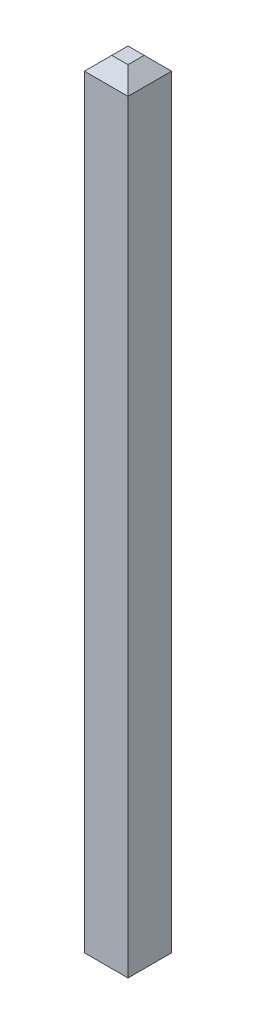
ISO-10303-21;
HEADER;
FILE_DESCRIPTION(('STEP AP214'),'2;1');
FILE_NAME('part.step','',(''),(''),'','','');
FILE_SCHEMA(('AUTOMOTIVE_DESIGN { 1 0 10303 214 1 1 1 1 }'));
ENDSEC;
DATA;
#1=APPLICATION_CONTEXT('core data for automotive mechanical design processes');
#2=APPLICATION_PROTOCOL_DEFINITION('international standard','automotive_design',2000,#1);
#3=PRODUCT_CONTEXT('',#1,'mechanical');
#4=PRODUCT('Part','Part','',(#3));
#5=PRODUCT_RELATED_PRODUCT_CATEGORY('part','',(#4));
#6=PRODUCT_DEFINITION_FORMATION('','',#4);
#7=PRODUCT_DEFINITION_CONTEXT('part definition',#1,'design');
#8=PRODUCT_DEFINITION('design','',#6,#7);
#9=PRODUCT_DEFINITION_SHAPE('','',#8);
#10=(LENGTH_UNIT() NAMED_UNIT(*) SI_UNIT(.MILLI.,.METRE.));
#11=(NAMED_UNIT(*) PLANE_ANGLE_UNIT() SI_UNIT($,.RADIAN.));
#12=(NAMED_UNIT(*) SI_UNIT($,.STERADIAN.) SOLID_ANGLE_UNIT());
#13=UNCERTAINTY_MEASURE_WITH_UNIT(LENGTH_MEASURE(1.E-05),#10,'distance_accuracy_value','');
#14=(GEOMETRIC_REPRESENTATION_CONTEXT(3) GLOBAL_UNCERTAINTY_ASSIGNED_CONTEXT((#13)) GLOBAL_UNIT_ASSIGNED_CONTEXT((#10,
#11,#12)) REPRESENTATION_CONTEXT('',''));
#15=CARTESIAN_POINT('',(0.,0.,0.));
#16=DIRECTION('',(0.,0.,1.));
#17=DIRECTION('',(1.,0.,0.));
#18=AXIS2_PLACEMENT_3D('',#15,#16,#17);
#19=CARTESIAN_POINT('',(0.,11.54,0.));
#20=DIRECTION('',(1.,0.,0.));
#21=DIRECTION('',(0.,0.,-1.));
#22=AXIS2_PLACEMENT_3D('',#19,#20,#21);
#23=PLANE('',#22);
#24=DIRECTION('',(0.,-1.,0.));
#25=VECTOR('',#24,1.);
#26=CARTESIAN_POINT('',(0.,11.54,0.636));
#27=LINE('',#26,#25);
#28=CARTESIAN_POINT('',(0.,11.34,0.636));
#29=VERTEX_POINT('',#28);
#30=CARTESIAN_POINT('',(0.,0.199999999999999,0.636));
#31=VERTEX_POINT('',#30);
#32=EDGE_CURVE('E126',#29,#31,#27,.T.);
#33=ORIENTED_EDGE('',*,*,#32,.F.);
#34=DIRECTION('',(0.,0.,-1.));
#35=VECTOR('',#34,1.);
#36=CARTESIAN_POINT('',(0.,11.34,0.));
#37=LINE('',#36,#35);
#38=CARTESIAN_POINT('',(0.,11.34,0.));
#39=VERTEX_POINT('',#38);
#40=EDGE_CURVE('E151',#29,#39,#37,.T.);
#41=ORIENTED_EDGE('',*,*,#40,.T.);
#42=DIRECTION('',(0.,-1.,0.));
#43=VECTOR('',#42,1.);
#44=CARTESIAN_POINT('',(0.,11.54,0.));
#45=LINE('',#44,#43);
#46=CARTESIAN_POINT('',(0.,0.199999999999999,0.));
#47=VERTEX_POINT('',#46);
#48=EDGE_CURVE('E120',#39,#47,#45,.T.);
#49=ORIENTED_EDGE('',*,*,#48,.T.);
#50=DIRECTION('',(0.,0.,1.));
#51=VECTOR('',#50,1.);
#52=CARTESIAN_POINT('',(0.,0.199999999999999,0.));
#53=LINE('',#52,#51);
#54=EDGE_CURVE('E148',#47,#31,#53,.T.);
#55=ORIENTED_EDGE('',*,*,#54,.T.);
#56=EDGE_LOOP('',(#33,#41,#49,#55));
#57=FACE_BOUND('',#56,.T.);
#58=ADVANCED_FACE('F34',(#57),#23,.F.);
#59=CARTESIAN_POINT('',(0.,11.54,0.636));
#60=DIRECTION('',(0.,0.,-1.));
#61=DIRECTION('',(-1.,0.,0.));
#62=AXIS2_PLACEMENT_3D('',#59,#60,#61);
#63=PLANE('',#62);
#64=DIRECTION('',(0.,-1.,0.));
#65=VECTOR('',#64,1.);
#66=CARTESIAN_POINT('',(0.636,11.54,0.636));
#67=LINE('',#66,#65);
#68=CARTESIAN_POINT('',(0.636,11.34,0.636));
#69=VERTEX_POINT('',#68);
#70=CARTESIAN_POINT('',(0.636,0.199999999999999,0.636));
#71=VERTEX_POINT('',#70);
#72=EDGE_CURVE('E129',#69,#71,#67,.T.);
#73=ORIENTED_EDGE('',*,*,#72,.F.);
#74=DIRECTION('',(-1.,0.,0.));
#75=VECTOR('',#74,1.);
#76=CARTESIAN_POINT('',(0.,11.34,0.636));
#77=LINE('',#76,#75);
#78=EDGE_CURVE('E138',#69,#29,#77,.T.);
#79=ORIENTED_EDGE('',*,*,#78,.T.);
#80=ORIENTED_EDGE('',*,*,#32,.T.);
#81=DIRECTION('',(1.,0.,0.));
#82=VECTOR('',#81,1.);
#83=CARTESIAN_POINT('',(0.,0.199999999999999,0.636));
#84=LINE('',#83,#82);
#85=EDGE_CURVE('E136',#31,#71,#84,.T.);
#86=ORIENTED_EDGE('',*,*,#85,.T.);
#87=EDGE_LOOP('',(#73,#79,#80,#86));
#88=FACE_BOUND('',#87,.T.);
#89=ADVANCED_FACE('F188',(#88),#63,.F.);
#90=CARTESIAN_POINT('',(0.636,11.54,0.));
#91=DIRECTION('',(-1.,0.,0.));
#92=DIRECTION('',(0.,0.,1.));
#93=AXIS2_PLACEMENT_3D('',#90,#91,#92);
#94=PLANE('',#93);
#95=DIRECTION('',(0.,-1.,0.));
#96=VECTOR('',#95,1.);
#97=CARTESIAN_POINT('',(0.636,11.54,0.));
#98=LINE('',#97,#96);
#99=CARTESIAN_POINT('',(0.636,11.34,0.));
#100=VERTEX_POINT('',#99);
#101=CARTESIAN_POINT('',(0.636,0.199999999999999,0.));
#102=VERTEX_POINT('',#101);
#103=EDGE_CURVE('E200',#100,#102,#98,.T.);
#104=ORIENTED_EDGE('',*,*,#103,.F.);
#105=DIRECTION('',(0.,0.,1.));
#106=VECTOR('',#105,1.);
#107=CARTESIAN_POINT('',(0.636,11.34,0.636));
#108=LINE('',#107,#106);
#109=EDGE_CURVE('E143',#100,#69,#108,.T.);
#110=ORIENTED_EDGE('',*,*,#109,.T.);
#111=ORIENTED_EDGE('',*,*,#72,.T.);
#112=DIRECTION('',(0.,0.,-1.));
#113=VECTOR('',#112,1.);
#114=CARTESIAN_POINT('',(0.636,0.199999999999999,0.));
#115=LINE('',#114,#113);
#116=EDGE_CURVE('E141',#71,#102,#115,.T.);
#117=ORIENTED_EDGE('',*,*,#116,.T.);
#118=EDGE_LOOP('',(#104,#110,#111,#117));
#119=FACE_BOUND('',#118,.T.);
#120=ADVANCED_FACE('F198',(#119),#94,.F.);
#121=CARTESIAN_POINT('',(0.,11.54,0.));
#122=DIRECTION('',(0.,0.,1.));
#123=DIRECTION('',(1.,0.,0.));
#124=AXIS2_PLACEMENT_3D('',#121,#122,#123);
#125=PLANE('',#124);
#126=ORIENTED_EDGE('',*,*,#48,.F.);
#127=DIRECTION('',(1.,0.,0.));
#128=VECTOR('',#127,1.);
#129=CARTESIAN_POINT('',(0.636,11.34,0.));
#130=LINE('',#129,#128);
#131=EDGE_CURVE('E117',#39,#100,#130,.T.);
#132=ORIENTED_EDGE('',*,*,#131,.T.);
#133=ORIENTED_EDGE('',*,*,#103,.T.);
#134=DIRECTION('',(-1.,0.,0.));
#135=VECTOR('',#134,1.);
#136=CARTESIAN_POINT('',(0.,0.199999999999999,0.));
#137=LINE('',#136,#135);
#138=EDGE_CURVE('E145',#102,#47,#137,.T.);
#139=ORIENTED_EDGE('',*,*,#138,.T.);
#140=EDGE_LOOP('',(#126,#132,#133,#139));
#141=FACE_BOUND('',#140,.T.);
#142=ADVANCED_FACE('F204',(#141),#125,.F.);
#143=CARTESIAN_POINT('',(0.,11.54,0.));
#144=DIRECTION('',(0.,1.,0.));
#145=DIRECTION('',(0.,0.,1.));
#146=AXIS2_PLACEMENT_3D('',#143,#144,#145);
#147=PLANE('',#146);
#148=DIRECTION('',(0.,0.,1.));
#149=VECTOR('',#148,1.);
#150=CARTESIAN_POINT('',(0.199999999999999,11.54,0.636));
#151=LINE('',#150,#149);
#152=CARTESIAN_POINT('',(0.199999999999999,11.54,0.199999999999999));
#153=VERTEX_POINT('',#152);
#154=CARTESIAN_POINT('',(0.199999999999999,11.54,0.436000000000001));
#155=VERTEX_POINT('',#154);
#156=EDGE_CURVE('E105',#153,#155,#151,.T.);
#157=ORIENTED_EDGE('',*,*,#156,.T.);
#158=DIRECTION('',(1.,0.,0.));
#159=VECTOR('',#158,1.);
#160=CARTESIAN_POINT('',(0.636,11.54,0.436000000000001));
#161=LINE('',#160,#159);
#162=CARTESIAN_POINT('',(0.436000000000001,11.54,0.436000000000001));
#163=VERTEX_POINT('',#162);
#164=EDGE_CURVE('E134',#155,#163,#161,.T.);
#165=ORIENTED_EDGE('',*,*,#164,.T.);
#166=DIRECTION('',(0.,0.,-1.));
#167=VECTOR('',#166,1.);
#168=CARTESIAN_POINT('',(0.436000000000001,11.54,0.));
#169=LINE('',#168,#167);
#170=CARTESIAN_POINT('',(0.436000000000001,11.54,0.199999999999999));
#171=VERTEX_POINT('',#170);
#172=EDGE_CURVE('E108',#163,#171,#169,.T.);
#173=ORIENTED_EDGE('',*,*,#172,.T.);
#174=DIRECTION('',(-1.,0.,0.));
#175=VECTOR('',#174,1.);
#176=CARTESIAN_POINT('',(0.,11.54,0.199999999999999));
#177=LINE('',#176,#175);
#178=EDGE_CURVE('E100',#171,#153,#177,.T.);
#179=ORIENTED_EDGE('',*,*,#178,.T.);
#180=EDGE_LOOP('',(#157,#165,#173,#179));
#181=FACE_BOUND('',#180,.T.);
#182=ADVANCED_FACE('F102',(#181),#147,.T.);
#183=CARTESIAN_POINT('',(0.,0.,0.));
#184=DIRECTION('',(0.,1.,0.));
#185=DIRECTION('',(0.,0.,1.));
#186=AXIS2_PLACEMENT_3D('',#183,#184,#185);
#187=PLANE('',#186);
#188=DIRECTION('',(-1.,0.,0.));
#189=VECTOR('',#188,1.);
#190=CARTESIAN_POINT('',(0.,0.,0.436000000000001));
#191=LINE('',#190,#189);
#192=CARTESIAN_POINT('',(0.436000000000001,0.,0.436000000000001));
#193=VERTEX_POINT('',#192);
#194=CARTESIAN_POINT('',(0.199999999999999,0.,0.436000000000001));
#195=VERTEX_POINT('',#194);
#196=EDGE_CURVE('E153',#193,#195,#191,.T.);
#197=ORIENTED_EDGE('',*,*,#196,.T.);
#198=DIRECTION('',(0.,0.,-1.));
#199=VECTOR('',#198,1.);
#200=CARTESIAN_POINT('',(0.199999999999999,0.,0.));
#201=LINE('',#200,#199);
#202=CARTESIAN_POINT('',(0.199999999999999,0.,0.199999999999999));
#203=VERTEX_POINT('',#202);
#204=EDGE_CURVE('E11',#195,#203,#201,.T.);
#205=ORIENTED_EDGE('',*,*,#204,.T.);
#206=DIRECTION('',(1.,0.,0.));
#207=VECTOR('',#206,1.);
#208=CARTESIAN_POINT('',(0.,0.,0.199999999999999));
#209=LINE('',#208,#207);
#210=CARTESIAN_POINT('',(0.436000000000001,0.,0.199999999999999));
#211=VERTEX_POINT('',#210);
#212=EDGE_CURVE('E43',#203,#211,#209,.T.);
#213=ORIENTED_EDGE('',*,*,#212,.T.);
#214=DIRECTION('',(0.,0.,1.));
#215=VECTOR('',#214,1.);
#216=CARTESIAN_POINT('',(0.436000000000001,0.,0.));
#217=LINE('',#216,#215);
#218=EDGE_CURVE('E155',#211,#193,#217,.T.);
#219=ORIENTED_EDGE('',*,*,#218,.T.);
#220=EDGE_LOOP('',(#197,#205,#213,#219));
#221=FACE_BOUND('',#220,.T.);
#222=ADVANCED_FACE('F177',(#221),#187,.F.);
#223=CARTESIAN_POINT('',(0.,11.54,0.199999999999999));
#224=DIRECTION('',(0.,0.707106781186548,-0.707106781186548));
#225=DIRECTION('',(1.,0.,0.));
#226=AXIS2_PLACEMENT_3D('',#223,#224,#225);
#227=PLANE('',#226);
#228=DIRECTION('',(0.577350269189626,-0.577350269189626,-0.577350269189626));
#229=VECTOR('',#228,1.);
#230=CARTESIAN_POINT('',(0.290666666666668,11.6853333333333,0.345333333333333));
#231=LINE('',#230,#229);
#232=EDGE_CURVE('E121',#100,#171,#231,.F.);
#233=ORIENTED_EDGE('',*,*,#232,.F.);
#234=ORIENTED_EDGE('',*,*,#131,.F.);
#235=DIRECTION('',(-0.577350269189626,-0.577350269189626,-0.577350269189626));
#236=VECTOR('',#235,1.);
#237=CARTESIAN_POINT('',(0.133333333333333,11.4733333333333,0.133333333333332));
#238=LINE('',#237,#236);
#239=EDGE_CURVE('E115',#153,#39,#238,.T.);
#240=ORIENTED_EDGE('',*,*,#239,.F.);
#241=ORIENTED_EDGE('',*,*,#178,.F.);
#242=EDGE_LOOP('',(#233,#234,#240,#241));
#243=FACE_BOUND('',#242,.T.);
#244=ADVANCED_FACE('F116',(#243),#227,.T.);
#245=CARTESIAN_POINT('',(0.199999999999999,11.54,0.));
#246=DIRECTION('',(-0.707106781186548,0.707106781186548,0.));
#247=DIRECTION('',(0.,0.,-1.));
#248=AXIS2_PLACEMENT_3D('',#245,#246,#247);
#249=PLANE('',#248);
#250=ORIENTED_EDGE('',*,*,#239,.T.);
#251=ORIENTED_EDGE('',*,*,#40,.F.);
#252=DIRECTION('',(0.577350269189626,0.577350269189626,-0.577350269189626));
#253=VECTOR('',#252,1.);
#254=CARTESIAN_POINT('',(0.345333333333333,11.6853333333333,0.290666666666668));
#255=LINE('',#254,#253);
#256=EDGE_CURVE('E124',#155,#29,#255,.F.);
#257=ORIENTED_EDGE('',*,*,#256,.F.);
#258=ORIENTED_EDGE('',*,*,#156,.F.);
#259=EDGE_LOOP('',(#250,#251,#257,#258));
#260=FACE_BOUND('',#259,.T.);
#261=ADVANCED_FACE('F123',(#260),#249,.T.);
#262=CARTESIAN_POINT('',(0.436000000000001,11.54,0.));
#263=DIRECTION('',(0.707106781186548,0.707106781186548,0.));
#264=DIRECTION('',(0.,0.,1.));
#265=AXIS2_PLACEMENT_3D('',#262,#263,#264);
#266=PLANE('',#265);
#267=ORIENTED_EDGE('',*,*,#232,.T.);
#268=ORIENTED_EDGE('',*,*,#172,.F.);
#269=DIRECTION('',(0.577350269189626,-0.577350269189626,0.577350269189626));
#270=VECTOR('',#269,1.);
#271=CARTESIAN_POINT('',(0.290666666666668,11.6853333333333,0.290666666666667));
#272=LINE('',#271,#270);
#273=EDGE_CURVE('E158',#69,#163,#272,.F.);
#274=ORIENTED_EDGE('',*,*,#273,.F.);
#275=ORIENTED_EDGE('',*,*,#109,.F.);
#276=EDGE_LOOP('',(#267,#268,#274,#275));
#277=FACE_BOUND('',#276,.T.);
#278=ADVANCED_FACE('F195',(#277),#266,.T.);
#279=CARTESIAN_POINT('',(0.,11.54,0.436000000000001));
#280=DIRECTION('',(0.,0.707106781186548,0.707106781186548));
#281=DIRECTION('',(-1.,0.,0.));
#282=AXIS2_PLACEMENT_3D('',#279,#280,#281);
#283=PLANE('',#282);
#284=ORIENTED_EDGE('',*,*,#256,.T.);
#285=ORIENTED_EDGE('',*,*,#78,.F.);
#286=ORIENTED_EDGE('',*,*,#273,.T.);
#287=ORIENTED_EDGE('',*,*,#164,.F.);
#288=EDGE_LOOP('',(#284,#285,#286,#287));
#289=FACE_BOUND('',#288,.T.);
#290=ADVANCED_FACE('F192',(#289),#283,.T.);
#291=CARTESIAN_POINT('',(0.636,0.199999999999999,0.));
#292=DIRECTION('',(-0.707106781186548,0.707106781186548,0.));
#293=DIRECTION('',(0.,0.,-1.));
#294=AXIS2_PLACEMENT_3D('',#291,#292,#293);
#295=PLANE('',#294);
#296=DIRECTION('',(0.577350269189626,0.577350269189626,0.577350269189626));
#297=VECTOR('',#296,1.);
#298=CARTESIAN_POINT('',(0.424,-0.0120000000000012,0.424));
#299=LINE('',#298,#297);
#300=EDGE_CURVE('E164',#193,#71,#299,.T.);
#301=ORIENTED_EDGE('',*,*,#300,.F.);
#302=ORIENTED_EDGE('',*,*,#218,.F.);
#303=DIRECTION('',(0.577350269189626,0.577350269189626,-0.577350269189626));
#304=VECTOR('',#303,1.);
#305=CARTESIAN_POINT('',(0.636,0.199999999999999,0.));
#306=LINE('',#305,#304);
#307=EDGE_CURVE('E38',#102,#211,#306,.F.);
#308=ORIENTED_EDGE('',*,*,#307,.F.);
#309=ORIENTED_EDGE('',*,*,#116,.F.);
#310=EDGE_LOOP('',(#301,#302,#308,#309));
#311=FACE_BOUND('',#310,.T.);
#312=ADVANCED_FACE('F36',(#311),#295,.F.);
#313=CARTESIAN_POINT('',(0.,0.199999999999999,0.));
#314=DIRECTION('',(0.,0.707106781186548,0.707106781186548));
#315=DIRECTION('',(-1.,0.,0.));
#316=AXIS2_PLACEMENT_3D('',#313,#314,#315);
#317=PLANE('',#316);
#318=ORIENTED_EDGE('',*,*,#307,.T.);
#319=ORIENTED_EDGE('',*,*,#212,.F.);
#320=DIRECTION('',(-0.577350269189626,0.577350269189626,-0.577350269189626));
#321=VECTOR('',#320,1.);
#322=CARTESIAN_POINT('',(0.,0.199999999999999,0.));
#323=LINE('',#322,#321);
#324=EDGE_CURVE('E51',#47,#203,#323,.F.);
#325=ORIENTED_EDGE('',*,*,#324,.F.);
#326=ORIENTED_EDGE('',*,*,#138,.F.);
#327=EDGE_LOOP('',(#318,#319,#325,#326));
#328=FACE_BOUND('',#327,.T.);
#329=ADVANCED_FACE('F174',(#328),#317,.F.);
#330=CARTESIAN_POINT('',(0.,0.199999999999999,0.636));
#331=DIRECTION('',(0.,0.707106781186548,-0.707106781186548));
#332=DIRECTION('',(1.,0.,0.));
#333=AXIS2_PLACEMENT_3D('',#330,#331,#332);
#334=PLANE('',#333);
#335=ORIENTED_EDGE('',*,*,#300,.T.);
#336=ORIENTED_EDGE('',*,*,#85,.F.);
#337=DIRECTION('',(0.577350269189626,-0.577350269189626,-0.577350269189626));
#338=VECTOR('',#337,1.);
#339=CARTESIAN_POINT('',(0.,0.199999999999999,0.636));
#340=LINE('',#339,#338);
#341=EDGE_CURVE('E162',#195,#31,#340,.F.);
#342=ORIENTED_EDGE('',*,*,#341,.F.);
#343=ORIENTED_EDGE('',*,*,#196,.F.);
#344=EDGE_LOOP('',(#335,#336,#342,#343));
#345=FACE_BOUND('',#344,.T.);
#346=ADVANCED_FACE('F180',(#345),#334,.F.);
#347=CARTESIAN_POINT('',(0.,0.199999999999999,0.));
#348=DIRECTION('',(0.707106781186548,0.707106781186548,0.));
#349=DIRECTION('',(0.,0.,1.));
#350=AXIS2_PLACEMENT_3D('',#347,#348,#349);
#351=PLANE('',#350);
#352=ORIENTED_EDGE('',*,*,#324,.T.);
#353=ORIENTED_EDGE('',*,*,#204,.F.);
#354=ORIENTED_EDGE('',*,*,#341,.T.);
#355=ORIENTED_EDGE('',*,*,#54,.F.);
#356=EDGE_LOOP('',(#352,#353,#354,#355));
#357=FACE_BOUND('',#356,.T.);
#358=ADVANCED_FACE('F179',(#357),#351,.F.);
#359=CLOSED_SHELL('',(#58,#89,#120,#142,#182,#222,#244,#261,#278,#290,#312,#329,#346,#358));
#360=MANIFOLD_SOLID_BREP('B2',#359);
#361=ADVANCED_BREP_SHAPE_REPRESENTATION('',(#18,#360),#14);
#362=SHAPE_DEFINITION_REPRESENTATION(#9,#361);
ENDSEC;
END-ISO-10303-21;
